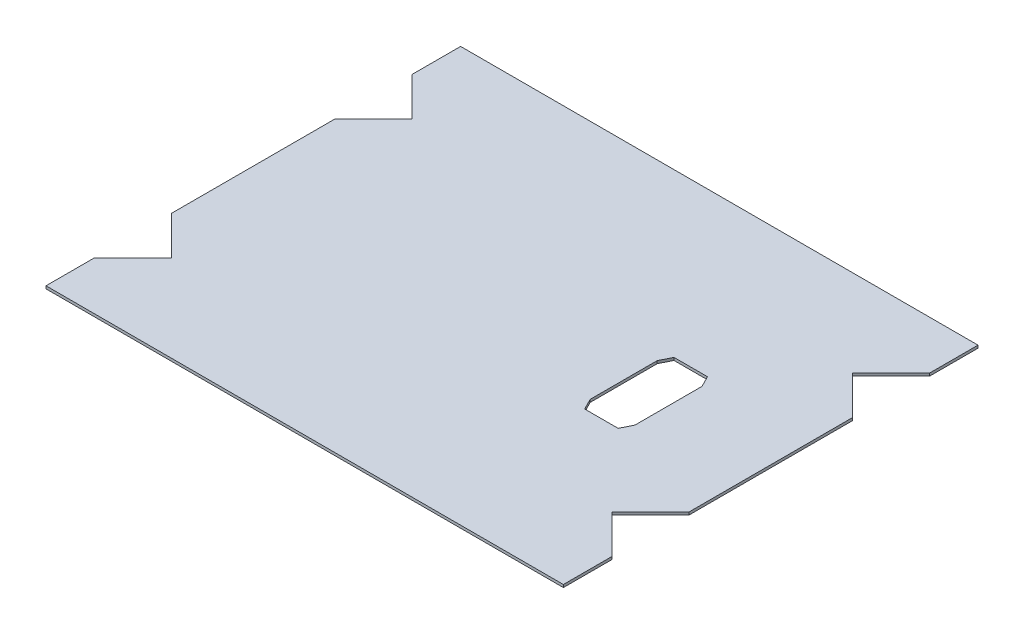
ISO-10303-21;
HEADER;
FILE_DESCRIPTION(('STEP AP214'),'2;1');
FILE_NAME('part.step','',(''),(''),'','','');
FILE_SCHEMA(('AUTOMOTIVE_DESIGN { 1 0 10303 214 1 1 1 1 }'));
ENDSEC;
DATA;
#1=APPLICATION_CONTEXT('core data for automotive mechanical design processes');
#2=APPLICATION_PROTOCOL_DEFINITION('international standard','automotive_design',2000,#1);
#3=PRODUCT_CONTEXT('',#1,'mechanical');
#4=PRODUCT('Part','Part','',(#3));
#5=PRODUCT_RELATED_PRODUCT_CATEGORY('part','',(#4));
#6=PRODUCT_DEFINITION_FORMATION('','',#4);
#7=PRODUCT_DEFINITION_CONTEXT('part definition',#1,'design');
#8=PRODUCT_DEFINITION('design','',#6,#7);
#9=PRODUCT_DEFINITION_SHAPE('','',#8);
#10=(LENGTH_UNIT() NAMED_UNIT(*) SI_UNIT(.MILLI.,.METRE.));
#11=(NAMED_UNIT(*) PLANE_ANGLE_UNIT() SI_UNIT($,.RADIAN.));
#12=(NAMED_UNIT(*) SI_UNIT($,.STERADIAN.) SOLID_ANGLE_UNIT());
#13=UNCERTAINTY_MEASURE_WITH_UNIT(LENGTH_MEASURE(1.E-05),#10,'distance_accuracy_value','');
#14=(GEOMETRIC_REPRESENTATION_CONTEXT(3) GLOBAL_UNCERTAINTY_ASSIGNED_CONTEXT((#13)) GLOBAL_UNIT_ASSIGNED_CONTEXT((#10,
#11,#12)) REPRESENTATION_CONTEXT('',''));
#15=CARTESIAN_POINT('',(0.,0.,0.));
#16=DIRECTION('',(0.,0.,1.));
#17=DIRECTION('',(1.,0.,0.));
#18=AXIS2_PLACEMENT_3D('',#15,#16,#17);
#19=CARTESIAN_POINT('',(0.,1.2,0.));
#20=DIRECTION('',(0.,1.,0.));
#21=DIRECTION('',(0.,0.,1.));
#22=AXIS2_PLACEMENT_3D('',#19,#20,#21);
#23=PLANE('',#22);
#24=DIRECTION('',(0.707106781186545,0.,0.70710678118655));
#25=VECTOR('',#24,1.);
#26=CARTESIAN_POINT('',(125.097205420987,1.19999999999984,-27.3232233047033));
#27=LINE('',#26,#25);
#28=CARTESIAN_POINT('',(98.5334376675488,1.20000000000002,-53.8869910581421));
#29=VERTEX_POINT('',#28);
#30=CARTESIAN_POINT('',(115.773982116284,1.1999999999999,-36.6464466094066));
#31=VERTEX_POINT('',#30);
#32=EDGE_CURVE('E821',#29,#31,#27,.T.);
#33=ORIENTED_EDGE('',*,*,#32,.F.);
#34=DIRECTION('',(0.707106781186545,0.,-0.70710678118655));
#35=VECTOR('',#34,1.);
#36=CARTESIAN_POINT('',(125.097205420987,1.19999999999966,-80.4507588115806));
#37=LINE('',#36,#35);
#38=CARTESIAN_POINT('',(115.773982116284,1.19999999999979,-71.1275355068775));
#39=VERTEX_POINT('',#38);
#40=EDGE_CURVE('E710',#29,#39,#37,.T.);
#41=ORIENTED_EDGE('',*,*,#40,.T.);
#42=DIRECTION('',(0.,0.,-1.));
#43=VECTOR('',#42,1.);
#44=CARTESIAN_POINT('',(115.773982116284,1.19999999999991,-54.9739821162841));
#45=LINE('',#44,#43);
#46=CARTESIAN_POINT('',(115.773982116284,1.19999999999962,-92.7739821162841));
#47=VERTEX_POINT('',#46);
#48=EDGE_CURVE('E721',#47,#39,#45,.F.);
#49=ORIENTED_EDGE('',*,*,#48,.F.);
#50=DIRECTION('',(-1.,0.,0.));
#51=VECTOR('',#50,1.);
#52=CARTESIAN_POINT('',(-98.9739821162841,1.19999999999975,-92.7739821162841));
#53=LINE('',#52,#51);
#54=CARTESIAN_POINT('',(-115.773982116284,1.19999999999962,-92.7739821162841));
#55=VERTEX_POINT('',#54);
#56=EDGE_CURVE('E738',#55,#47,#53,.F.);
#57=ORIENTED_EDGE('',*,*,#56,.F.);
#58=DIRECTION('',(0.,0.,1.));
#59=VECTOR('',#58,1.);
#60=CARTESIAN_POINT('',(-115.773982116284,1.19999999999962,-92.7739821162841));
#61=LINE('',#60,#59);
#62=CARTESIAN_POINT('',(-115.773982116284,1.19999999999978,-71.1275355068775));
#63=VERTEX_POINT('',#62);
#64=EDGE_CURVE('E735',#63,#55,#61,.F.);
#65=ORIENTED_EDGE('',*,*,#64,.F.);
#66=DIRECTION('',(0.707106781186545,0.,0.70710678118655));
#67=VECTOR('',#66,1.);
#68=CARTESIAN_POINT('',(-125.097205420987,1.19999999999966,-80.4507588115806));
#69=LINE('',#68,#67);
#70=CARTESIAN_POINT('',(-98.5334376675488,1.20000000000002,-53.8869910581421));
#71=VERTEX_POINT('',#70);
#72=EDGE_CURVE('E714',#63,#71,#69,.T.);
#73=ORIENTED_EDGE('',*,*,#72,.T.);
#74=DIRECTION('',(-0.707106781186545,0.,0.70710678118655));
#75=VECTOR('',#74,1.);
#76=CARTESIAN_POINT('',(-125.097205420987,1.19999999999981,-27.3232233047034));
#77=LINE('',#76,#75);
#78=CARTESIAN_POINT('',(-115.773982116284,1.19999999999988,-36.6464466094066));
#79=VERTEX_POINT('',#78);
#80=EDGE_CURVE('E681',#71,#79,#77,.T.);
#81=ORIENTED_EDGE('',*,*,#80,.T.);
#82=DIRECTION('',(0.,0.,1.));
#83=VECTOR('',#82,1.);
#84=CARTESIAN_POINT('',(-115.773982116284,1.19999999999985,-52.8));
#85=LINE('',#84,#83);
#86=CARTESIAN_POINT('',(-115.773982116284,1.1999999999999,36.6464466094067));
#87=VERTEX_POINT('',#86);
#88=EDGE_CURVE('E747',#87,#79,#85,.F.);
#89=ORIENTED_EDGE('',*,*,#88,.F.);
#90=DIRECTION('',(0.707106781186545,0.,0.70710678118655));
#91=VECTOR('',#90,1.);
#92=CARTESIAN_POINT('',(-125.097205420987,1.19999999999981,27.3232233047034));
#93=LINE('',#92,#91);
#94=CARTESIAN_POINT('',(-98.5334376675488,1.20000000000001,53.8869910581421));
#95=VERTEX_POINT('',#94);
#96=EDGE_CURVE('E809',#87,#95,#93,.T.);
#97=ORIENTED_EDGE('',*,*,#96,.T.);
#98=DIRECTION('',(-0.707106781186545,0.,0.70710678118655));
#99=VECTOR('',#98,1.);
#100=CARTESIAN_POINT('',(-125.097205420987,1.19999999999963,80.4507588115806));
#101=LINE('',#100,#99);
#102=CARTESIAN_POINT('',(-115.773982116284,1.19999999999976,71.1275355068776));
#103=VERTEX_POINT('',#102);
#104=EDGE_CURVE('E762',#95,#103,#101,.T.);
#105=ORIENTED_EDGE('',*,*,#104,.T.);
#106=DIRECTION('',(0.,0.,1.));
#107=VECTOR('',#106,1.);
#108=CARTESIAN_POINT('',(-115.773982116284,1.19999999999988,54.9739821162841));
#109=LINE('',#108,#107);
#110=CARTESIAN_POINT('',(-115.773982116284,1.1999999999996,92.7739821162842));
#111=VERTEX_POINT('',#110);
#112=EDGE_CURVE('E770',#111,#103,#109,.F.);
#113=ORIENTED_EDGE('',*,*,#112,.F.);
#114=DIRECTION('',(1.,0.,0.));
#115=VECTOR('',#114,1.);
#116=CARTESIAN_POINT('',(-115.773982116284,1.1999999999996,92.7739821162842));
#117=LINE('',#116,#115);
#118=CARTESIAN_POINT('',(115.773982116284,1.19999999999968,92.7739821162842));
#119=VERTEX_POINT('',#118);
#120=EDGE_CURVE('E705',#119,#111,#117,.F.);
#121=ORIENTED_EDGE('',*,*,#120,.F.);
#122=DIRECTION('',(0.,0.,1.));
#123=VECTOR('',#122,1.);
#124=CARTESIAN_POINT('',(115.773982116284,1.19999999999983,54.9739821162842));
#125=LINE('',#124,#123);
#126=CARTESIAN_POINT('',(115.773982116284,1.19999999999976,71.1275355068776));
#127=VERTEX_POINT('',#126);
#128=EDGE_CURVE('E784',#127,#119,#125,.T.);
#129=ORIENTED_EDGE('',*,*,#128,.F.);
#130=DIRECTION('',(0.707106781186543,0.,0.707106781186552));
#131=VECTOR('',#130,1.);
#132=CARTESIAN_POINT('',(125.097205420987,1.19999999999967,80.4507588115807));
#133=LINE('',#132,#131);
#134=CARTESIAN_POINT('',(98.5334376675488,1.19999999999994,53.8869910581421));
#135=VERTEX_POINT('',#134);
#136=EDGE_CURVE('E758',#135,#127,#133,.T.);
#137=ORIENTED_EDGE('',*,*,#136,.F.);
#138=DIRECTION('',(-0.707106781186545,0.,0.70710678118655));
#139=VECTOR('',#138,1.);
#140=CARTESIAN_POINT('',(125.097205420987,1.19999999999985,27.3232233047033));
#141=LINE('',#140,#139);
#142=CARTESIAN_POINT('',(115.773982116284,1.19999999999992,36.6464466094066));
#143=VERTEX_POINT('',#142);
#144=EDGE_CURVE('E832',#143,#135,#141,.T.);
#145=ORIENTED_EDGE('',*,*,#144,.F.);
#146=DIRECTION('',(0.,0.,1.));
#147=VECTOR('',#146,1.);
#148=CARTESIAN_POINT('',(115.773982116284,1.1999999999999,-52.8));
#149=LINE('',#148,#147);
#150=EDGE_CURVE('E798',#31,#143,#149,.T.);
#151=ORIENTED_EDGE('',*,*,#150,.F.);
#152=EDGE_LOOP('',(#33,#41,#49,#57,#65,#73,#81,#89,#97,#105,#113,#121,#129,#137,#145,#151));
#153=FACE_BOUND('',#152,.T.);
#154=DIRECTION('',(1.,0.,0.));
#155=VECTOR('',#154,1.);
#156=CARTESIAN_POINT('',(67.5000000000001,1.2,20.));
#157=LINE('',#156,#155);
#158=CARTESIAN_POINT('',(52.5000000000001,1.2,20.));
#159=VERTEX_POINT('',#158);
#160=CARTESIAN_POINT('',(67.5000000000001,1.2,20.));
#161=VERTEX_POINT('',#160);
#162=EDGE_CURVE('E845',#159,#161,#157,.T.);
#163=ORIENTED_EDGE('',*,*,#162,.F.);
#164=DIRECTION('',(0.447213595499956,0.,0.894427190999917));
#165=VECTOR('',#164,1.);
#166=CARTESIAN_POINT('',(50.0000000000001,1.2,15.));
#167=LINE('',#166,#165);
#168=CARTESIAN_POINT('',(50.0000000000001,1.2,15.));
#169=VERTEX_POINT('',#168);
#170=EDGE_CURVE('E842',#169,#159,#167,.T.);
#171=ORIENTED_EDGE('',*,*,#170,.F.);
#172=DIRECTION('',(0.,0.,1.));
#173=VECTOR('',#172,1.);
#174=CARTESIAN_POINT('',(50.0000000000001,1.2,-15.));
#175=LINE('',#174,#173);
#176=CARTESIAN_POINT('',(50.0000000000001,1.2,-15.));
#177=VERTEX_POINT('',#176);
#178=EDGE_CURVE('E864',#177,#169,#175,.T.);
#179=ORIENTED_EDGE('',*,*,#178,.F.);
#180=DIRECTION('',(-0.447213595499956,0.,0.894427190999917));
#181=VECTOR('',#180,1.);
#182=CARTESIAN_POINT('',(50.0000000000001,1.2,-15.));
#183=LINE('',#182,#181);
#184=CARTESIAN_POINT('',(52.5000000000001,1.2,-20.));
#185=VERTEX_POINT('',#184);
#186=EDGE_CURVE('E861',#185,#177,#183,.T.);
#187=ORIENTED_EDGE('',*,*,#186,.F.);
#188=DIRECTION('',(-1.,0.,0.));
#189=VECTOR('',#188,1.);
#190=CARTESIAN_POINT('',(67.5000000000001,1.2,-20.));
#191=LINE('',#190,#189);
#192=CARTESIAN_POINT('',(67.5000000000001,1.2,-20.));
#193=VERTEX_POINT('',#192);
#194=EDGE_CURVE('E858',#193,#185,#191,.T.);
#195=ORIENTED_EDGE('',*,*,#194,.F.);
#196=DIRECTION('',(-0.447213595499958,0.,-0.894427190999916));
#197=VECTOR('',#196,1.);
#198=CARTESIAN_POINT('',(70.0000000000001,1.2,-15.));
#199=LINE('',#198,#197);
#200=CARTESIAN_POINT('',(70.0000000000001,1.2,-15.));
#201=VERTEX_POINT('',#200);
#202=EDGE_CURVE('E855',#201,#193,#199,.T.);
#203=ORIENTED_EDGE('',*,*,#202,.F.);
#204=DIRECTION('',(0.,0.,-1.));
#205=VECTOR('',#204,1.);
#206=CARTESIAN_POINT('',(70.0000000000001,1.2,-15.));
#207=LINE('',#206,#205);
#208=CARTESIAN_POINT('',(70.0000000000001,1.2,15.));
#209=VERTEX_POINT('',#208);
#210=EDGE_CURVE('E852',#209,#201,#207,.T.);
#211=ORIENTED_EDGE('',*,*,#210,.F.);
#212=DIRECTION('',(0.447213595499958,0.,-0.894427190999916));
#213=VECTOR('',#212,1.);
#214=CARTESIAN_POINT('',(70.0000000000001,1.2,15.));
#215=LINE('',#214,#213);
#216=EDGE_CURVE('E849',#161,#209,#215,.T.);
#217=ORIENTED_EDGE('',*,*,#216,.F.);
#218=EDGE_LOOP('',(#163,#171,#179,#187,#195,#203,#211,#217));
#219=FACE_BOUND('',#218,.T.);
#220=ADVANCED_FACE('F495',(#153,#219),#23,.T.);
#221=CARTESIAN_POINT('',(0.,0.,0.));
#222=DIRECTION('',(0.,1.,0.));
#223=DIRECTION('',(0.,0.,1.));
#224=AXIS2_PLACEMENT_3D('',#221,#222,#223);
#225=PLANE('',#224);
#226=DIRECTION('',(0.707106781186545,0.,-0.70710678118655));
#227=VECTOR('',#226,1.);
#228=CARTESIAN_POINT('',(99.9739821162841,0.,-55.3275355068774));
#229=LINE('',#228,#227);
#230=CARTESIAN_POINT('',(98.5334376675488,0.,-53.8869910581421));
#231=VERTEX_POINT('',#230);
#232=CARTESIAN_POINT('',(115.773982116284,-2.28983498828939E-13,-71.1275355068775));
#233=VERTEX_POINT('',#232);
#234=EDGE_CURVE('E668',#231,#233,#229,.T.);
#235=ORIENTED_EDGE('',*,*,#234,.F.);
#236=DIRECTION('',(-0.707106781186545,0.,-0.70710678118655));
#237=VECTOR('',#236,1.);
#238=CARTESIAN_POINT('',(174.98597798299,-5.13478148889135E-13,22.5655492572994));
#239=LINE('',#238,#237);
#240=CARTESIAN_POINT('',(115.773982116284,-1.11022302462516E-13,-36.6464466094066));
#241=VERTEX_POINT('',#240);
#242=EDGE_CURVE('E814',#241,#231,#239,.T.);
#243=ORIENTED_EDGE('',*,*,#242,.F.);
#244=DIRECTION('',(0.,0.,-1.));
#245=VECTOR('',#244,1.);
#246=CARTESIAN_POINT('',(115.773982116284,0.,0.));
#247=LINE('',#246,#245);
#248=CARTESIAN_POINT('',(115.773982116284,0.,36.6464466094066));
#249=VERTEX_POINT('',#248);
#250=EDGE_CURVE('E825',#241,#249,#247,.F.);
#251=ORIENTED_EDGE('',*,*,#250,.T.);
#252=DIRECTION('',(0.707106781186545,0.,-0.70710678118655));
#253=VECTOR('',#252,1.);
#254=CARTESIAN_POINT('',(99.9739821162841,0.,52.4464466094067));
#255=LINE('',#254,#253);
#256=CARTESIAN_POINT('',(98.5334376675488,0.,53.8869910581421));
#257=VERTEX_POINT('',#256);
#258=EDGE_CURVE('E828',#257,#249,#255,.T.);
#259=ORIENTED_EDGE('',*,*,#258,.F.);
#260=DIRECTION('',(-0.707106781186543,0.,-0.707106781186552));
#261=VECTOR('',#260,1.);
#262=CARTESIAN_POINT('',(128.725646100053,-3.7470027081099E-13,84.0791994906469));
#263=LINE('',#262,#261);
#264=CARTESIAN_POINT('',(115.773982116284,-2.42861286636753E-13,71.1275355068776));
#265=VERTEX_POINT('',#264);
#266=EDGE_CURVE('E751',#265,#257,#263,.T.);
#267=ORIENTED_EDGE('',*,*,#266,.F.);
#268=DIRECTION('',(0.,0.,-1.));
#269=VECTOR('',#268,1.);
#270=CARTESIAN_POINT('',(115.773982116284,-1.80411241501588E-13,52.7739821162842));
#271=LINE('',#270,#269);
#272=CARTESIAN_POINT('',(115.773982116284,-3.2612801348364E-13,92.7739821162842));
#273=VERTEX_POINT('',#272);
#274=EDGE_CURVE('E781',#265,#273,#271,.F.);
#275=ORIENTED_EDGE('',*,*,#274,.T.);
#276=DIRECTION('',(1.,0.,0.));
#277=VECTOR('',#276,1.);
#278=CARTESIAN_POINT('',(152.773982116284,-5.759281940243E-13,92.7739821162843));
#279=LINE('',#278,#277);
#280=CARTESIAN_POINT('',(-115.773982116284,-4.09394740330526E-13,92.7739821162842));
#281=VERTEX_POINT('',#280);
#282=EDGE_CURVE('E778',#273,#281,#279,.F.);
#283=ORIENTED_EDGE('',*,*,#282,.T.);
#284=DIRECTION('',(0.,0.,-1.));
#285=VECTOR('',#284,1.);
#286=CARTESIAN_POINT('',(-115.773982116284,-1.11022302462516E-13,52.7739821162841));
#287=LINE('',#286,#285);
#288=CARTESIAN_POINT('',(-115.773982116284,-2.56739074444567E-13,71.1275355068776));
#289=VERTEX_POINT('',#288);
#290=EDGE_CURVE('E766',#281,#289,#287,.T.);
#291=ORIENTED_EDGE('',*,*,#290,.T.);
#292=DIRECTION('',(-0.707106781186545,0.,0.70710678118655));
#293=VECTOR('',#292,1.);
#294=CARTESIAN_POINT('',(-99.9739821162841,0.,55.3275355068775));
#295=LINE('',#294,#293);
#296=CARTESIAN_POINT('',(-98.5334376675487,0.,53.8869910581421));
#297=VERTEX_POINT('',#296);
#298=EDGE_CURVE('E748',#297,#289,#295,.T.);
#299=ORIENTED_EDGE('',*,*,#298,.F.);
#300=DIRECTION('',(0.707106781186545,0.,0.70710678118655));
#301=VECTOR('',#300,1.);
#302=CARTESIAN_POINT('',(-174.98597798299,-5.82867087928207E-13,-22.5655492572994));
#303=LINE('',#302,#301);
#304=CARTESIAN_POINT('',(-115.773982116284,-1.11022302462516E-13,36.6464466094067));
#305=VERTEX_POINT('',#304);
#306=EDGE_CURVE('E794',#305,#297,#303,.T.);
#307=ORIENTED_EDGE('',*,*,#306,.F.);
#308=DIRECTION('',(0.,0.,-1.));
#309=VECTOR('',#308,1.);
#310=CARTESIAN_POINT('',(-115.773982116284,-1.2490009027033E-13,0.));
#311=LINE('',#310,#309);
#312=CARTESIAN_POINT('',(-115.773982116284,-1.52655665885959E-13,-36.6464466094066));
#313=VERTEX_POINT('',#312);
#314=EDGE_CURVE('E675',#305,#313,#311,.T.);
#315=ORIENTED_EDGE('',*,*,#314,.T.);
#316=DIRECTION('',(-0.707106781186545,0.,0.70710678118655));
#317=VECTOR('',#316,1.);
#318=CARTESIAN_POINT('',(-99.9739821162841,0.,-52.4464466094067));
#319=LINE('',#318,#317);
#320=CARTESIAN_POINT('',(-98.5334376675488,0.,-53.8869910581421));
#321=VERTEX_POINT('',#320);
#322=EDGE_CURVE('E671',#321,#313,#319,.T.);
#323=ORIENTED_EDGE('',*,*,#322,.F.);
#324=DIRECTION('',(0.707106781186545,0.,0.70710678118655));
#325=VECTOR('',#324,1.);
#326=CARTESIAN_POINT('',(-128.725646100053,-4.02455846426619E-13,-84.0791994906468));
#327=LINE('',#326,#325);
#328=CARTESIAN_POINT('',(-115.773982116284,-2.28983498828939E-13,-71.1275355068775));
#329=VERTEX_POINT('',#328);
#330=EDGE_CURVE('E658',#329,#321,#327,.T.);
#331=ORIENTED_EDGE('',*,*,#330,.F.);
#332=DIRECTION('',(0.,0.,-1.));
#333=VECTOR('',#332,1.);
#334=CARTESIAN_POINT('',(-115.773982116284,0.,-52.7739821162841));
#335=LINE('',#334,#333);
#336=CARTESIAN_POINT('',(-115.773982116284,-3.81639164714898E-13,-92.7739821162841));
#337=VERTEX_POINT('',#336);
#338=EDGE_CURVE('E732',#329,#337,#335,.T.);
#339=ORIENTED_EDGE('',*,*,#338,.T.);
#340=DIRECTION('',(1.,0.,0.));
#341=VECTOR('',#340,1.);
#342=CARTESIAN_POINT('',(-152.773982116284,-6.31439345255558E-13,-92.7739821162841));
#343=LINE('',#342,#341);
#344=CARTESIAN_POINT('',(115.773982116284,-3.81639164714898E-13,-92.7739821162841));
#345=VERTEX_POINT('',#344);
#346=EDGE_CURVE('E729',#337,#345,#343,.T.);
#347=ORIENTED_EDGE('',*,*,#346,.T.);
#348=DIRECTION('',(0.,0.,1.));
#349=VECTOR('',#348,1.);
#350=CARTESIAN_POINT('',(115.773982116284,0.,-52.7739821162841));
#351=LINE('',#350,#349);
#352=EDGE_CURVE('E717',#345,#233,#351,.T.);
#353=ORIENTED_EDGE('',*,*,#352,.T.);
#354=EDGE_LOOP('',(#235,#243,#251,#259,#267,#275,#283,#291,#299,#307,#315,#323,#331,#339,#347,#353));
#355=FACE_BOUND('',#354,.T.);
#356=DIRECTION('',(0.447213595499956,0.,0.894427190999917));
#357=VECTOR('',#356,1.);
#358=CARTESIAN_POINT('',(50.0000000000001,0.,15.));
#359=LINE('',#358,#357);
#360=CARTESIAN_POINT('',(50.0000000000001,0.,15.));
#361=VERTEX_POINT('',#360);
#362=CARTESIAN_POINT('',(52.5000000000001,0.,20.));
#363=VERTEX_POINT('',#362);
#364=EDGE_CURVE('E518',#361,#363,#359,.T.);
#365=ORIENTED_EDGE('',*,*,#364,.T.);
#366=DIRECTION('',(1.,0.,0.));
#367=VECTOR('',#366,1.);
#368=CARTESIAN_POINT('',(67.5000000000001,0.,20.));
#369=LINE('',#368,#367);
#370=CARTESIAN_POINT('',(67.5000000000001,0.,20.));
#371=VERTEX_POINT('',#370);
#372=EDGE_CURVE('E870',#363,#371,#369,.T.);
#373=ORIENTED_EDGE('',*,*,#372,.T.);
#374=DIRECTION('',(0.447213595499958,0.,-0.894427190999916));
#375=VECTOR('',#374,1.);
#376=CARTESIAN_POINT('',(70.0000000000001,0.,15.));
#377=LINE('',#376,#375);
#378=CARTESIAN_POINT('',(70.0000000000001,0.,15.));
#379=VERTEX_POINT('',#378);
#380=EDGE_CURVE('E874',#371,#379,#377,.T.);
#381=ORIENTED_EDGE('',*,*,#380,.T.);
#382=DIRECTION('',(0.,0.,-1.));
#383=VECTOR('',#382,1.);
#384=CARTESIAN_POINT('',(70.0000000000001,0.,-15.));
#385=LINE('',#384,#383);
#386=CARTESIAN_POINT('',(70.0000000000001,0.,-15.));
#387=VERTEX_POINT('',#386);
#388=EDGE_CURVE('E878',#379,#387,#385,.T.);
#389=ORIENTED_EDGE('',*,*,#388,.T.);
#390=DIRECTION('',(-0.447213595499958,0.,-0.894427190999916));
#391=VECTOR('',#390,1.);
#392=CARTESIAN_POINT('',(70.0000000000001,0.,-15.));
#393=LINE('',#392,#391);
#394=CARTESIAN_POINT('',(67.5000000000001,0.,-20.));
#395=VERTEX_POINT('',#394);
#396=EDGE_CURVE('E882',#387,#395,#393,.T.);
#397=ORIENTED_EDGE('',*,*,#396,.T.);
#398=DIRECTION('',(-1.,0.,0.));
#399=VECTOR('',#398,1.);
#400=CARTESIAN_POINT('',(67.5000000000001,0.,-20.));
#401=LINE('',#400,#399);
#402=CARTESIAN_POINT('',(52.5000000000001,0.,-20.));
#403=VERTEX_POINT('',#402);
#404=EDGE_CURVE('E886',#395,#403,#401,.T.);
#405=ORIENTED_EDGE('',*,*,#404,.T.);
#406=DIRECTION('',(-0.447213595499956,0.,0.894427190999917));
#407=VECTOR('',#406,1.);
#408=CARTESIAN_POINT('',(50.0000000000001,0.,-15.));
#409=LINE('',#408,#407);
#410=CARTESIAN_POINT('',(50.0000000000001,0.,-15.));
#411=VERTEX_POINT('',#410);
#412=EDGE_CURVE('E890',#403,#411,#409,.T.);
#413=ORIENTED_EDGE('',*,*,#412,.T.);
#414=DIRECTION('',(0.,0.,1.));
#415=VECTOR('',#414,1.);
#416=CARTESIAN_POINT('',(50.0000000000001,0.,-15.));
#417=LINE('',#416,#415);
#418=EDGE_CURVE('E846',#411,#361,#417,.T.);
#419=ORIENTED_EDGE('',*,*,#418,.T.);
#420=EDGE_LOOP('',(#365,#373,#381,#389,#397,#405,#413,#419));
#421=FACE_BOUND('',#420,.T.);
#422=ADVANCED_FACE('F497',(#355,#421),#225,.F.);
#423=CARTESIAN_POINT('',(50.0000000000001,1.2,15.));
#424=DIRECTION('',(0.894427190999917,0.,-0.447213595499956));
#425=DIRECTION('',(-0.447213595499956,0.,-0.894427190999917));
#426=AXIS2_PLACEMENT_3D('',#423,#424,#425);
#427=PLANE('',#426);
#428=ORIENTED_EDGE('',*,*,#364,.F.);
#429=DIRECTION('',(0.,-1.,0.));
#430=VECTOR('',#429,1.);
#431=CARTESIAN_POINT('',(50.0000000000001,1.2,15.));
#432=LINE('',#431,#430);
#433=EDGE_CURVE('E867',#169,#361,#432,.T.);
#434=ORIENTED_EDGE('',*,*,#433,.F.);
#435=ORIENTED_EDGE('',*,*,#170,.T.);
#436=DIRECTION('',(0.,-1.,0.));
#437=VECTOR('',#436,1.);
#438=CARTESIAN_POINT('',(52.5000000000001,1.2,20.));
#439=LINE('',#438,#437);
#440=EDGE_CURVE('E13',#159,#363,#439,.T.);
#441=ORIENTED_EDGE('',*,*,#440,.T.);
#442=EDGE_LOOP('',(#428,#434,#435,#441));
#443=FACE_BOUND('',#442,.T.);
#444=ADVANCED_FACE('F928',(#443),#427,.T.);
#445=CARTESIAN_POINT('',(67.5000000000001,1.2,20.));
#446=DIRECTION('',(0.,0.,-1.));
#447=DIRECTION('',(-1.,0.,0.));
#448=AXIS2_PLACEMENT_3D('',#445,#446,#447);
#449=PLANE('',#448);
#450=ORIENTED_EDGE('',*,*,#372,.F.);
#451=ORIENTED_EDGE('',*,*,#440,.F.);
#452=ORIENTED_EDGE('',*,*,#162,.T.);
#453=DIRECTION('',(0.,-1.,0.));
#454=VECTOR('',#453,1.);
#455=CARTESIAN_POINT('',(67.5000000000001,1.2,20.));
#456=LINE('',#455,#454);
#457=EDGE_CURVE('E504',#161,#371,#456,.T.);
#458=ORIENTED_EDGE('',*,*,#457,.T.);
#459=EDGE_LOOP('',(#450,#451,#452,#458));
#460=FACE_BOUND('',#459,.T.);
#461=ADVANCED_FACE('F916',(#460),#449,.T.);
#462=CARTESIAN_POINT('',(70.0000000000001,1.2,15.));
#463=DIRECTION('',(-0.894427190999916,0.,-0.447213595499958));
#464=DIRECTION('',(-0.447213595499958,0.,0.894427190999916));
#465=AXIS2_PLACEMENT_3D('',#462,#463,#464);
#466=PLANE('',#465);
#467=ORIENTED_EDGE('',*,*,#380,.F.);
#468=ORIENTED_EDGE('',*,*,#457,.F.);
#469=ORIENTED_EDGE('',*,*,#216,.T.);
#470=DIRECTION('',(0.,-1.,0.));
#471=VECTOR('',#470,1.);
#472=CARTESIAN_POINT('',(70.0000000000001,1.2,15.));
#473=LINE('',#472,#471);
#474=EDGE_CURVE('E910',#209,#379,#473,.T.);
#475=ORIENTED_EDGE('',*,*,#474,.T.);
#476=EDGE_LOOP('',(#467,#468,#469,#475));
#477=FACE_BOUND('',#476,.T.);
#478=ADVANCED_FACE('F921',(#477),#466,.T.);
#479=CARTESIAN_POINT('',(70.0000000000001,1.2,-15.));
#480=DIRECTION('',(-1.,0.,0.));
#481=DIRECTION('',(0.,0.,1.));
#482=AXIS2_PLACEMENT_3D('',#479,#480,#481);
#483=PLANE('',#482);
#484=ORIENTED_EDGE('',*,*,#388,.F.);
#485=ORIENTED_EDGE('',*,*,#474,.F.);
#486=ORIENTED_EDGE('',*,*,#210,.T.);
#487=DIRECTION('',(0.,-1.,0.));
#488=VECTOR('',#487,1.);
#489=CARTESIAN_POINT('',(70.0000000000001,1.2,-15.));
#490=LINE('',#489,#488);
#491=EDGE_CURVE('E907',#201,#387,#490,.T.);
#492=ORIENTED_EDGE('',*,*,#491,.T.);
#493=EDGE_LOOP('',(#484,#485,#486,#492));
#494=FACE_BOUND('',#493,.T.);
#495=ADVANCED_FACE('F934',(#494),#483,.T.);
#496=CARTESIAN_POINT('',(70.0000000000001,1.2,-15.));
#497=DIRECTION('',(-0.894427190999916,0.,0.447213595499958));
#498=DIRECTION('',(0.447213595499958,0.,0.894427190999916));
#499=AXIS2_PLACEMENT_3D('',#496,#497,#498);
#500=PLANE('',#499);
#501=ORIENTED_EDGE('',*,*,#396,.F.);
#502=ORIENTED_EDGE('',*,*,#491,.F.);
#503=ORIENTED_EDGE('',*,*,#202,.T.);
#504=DIRECTION('',(0.,-1.,0.));
#505=VECTOR('',#504,1.);
#506=CARTESIAN_POINT('',(67.5000000000001,1.2,-20.));
#507=LINE('',#506,#505);
#508=EDGE_CURVE('E904',#193,#395,#507,.T.);
#509=ORIENTED_EDGE('',*,*,#508,.T.);
#510=EDGE_LOOP('',(#501,#502,#503,#509));
#511=FACE_BOUND('',#510,.T.);
#512=ADVANCED_FACE('F939',(#511),#500,.T.);
#513=CARTESIAN_POINT('',(67.5000000000001,1.2,-20.));
#514=DIRECTION('',(0.,0.,1.));
#515=DIRECTION('',(1.,0.,0.));
#516=AXIS2_PLACEMENT_3D('',#513,#514,#515);
#517=PLANE('',#516);
#518=ORIENTED_EDGE('',*,*,#404,.F.);
#519=ORIENTED_EDGE('',*,*,#508,.F.);
#520=ORIENTED_EDGE('',*,*,#194,.T.);
#521=DIRECTION('',(0.,-1.,0.));
#522=VECTOR('',#521,1.);
#523=CARTESIAN_POINT('',(52.5000000000001,1.2,-20.));
#524=LINE('',#523,#522);
#525=EDGE_CURVE('E901',#185,#403,#524,.T.);
#526=ORIENTED_EDGE('',*,*,#525,.T.);
#527=EDGE_LOOP('',(#518,#519,#520,#526));
#528=FACE_BOUND('',#527,.T.);
#529=ADVANCED_FACE('F943',(#528),#517,.T.);
#530=CARTESIAN_POINT('',(50.0000000000001,1.2,-15.));
#531=DIRECTION('',(0.894427190999917,0.,0.447213595499956));
#532=DIRECTION('',(0.447213595499956,0.,-0.894427190999917));
#533=AXIS2_PLACEMENT_3D('',#530,#531,#532);
#534=PLANE('',#533);
#535=ORIENTED_EDGE('',*,*,#412,.F.);
#536=ORIENTED_EDGE('',*,*,#525,.F.);
#537=ORIENTED_EDGE('',*,*,#186,.T.);
#538=DIRECTION('',(0.,-1.,0.));
#539=VECTOR('',#538,1.);
#540=CARTESIAN_POINT('',(50.0000000000001,1.2,-15.));
#541=LINE('',#540,#539);
#542=EDGE_CURVE('E511',#177,#411,#541,.T.);
#543=ORIENTED_EDGE('',*,*,#542,.T.);
#544=EDGE_LOOP('',(#535,#536,#537,#543));
#545=FACE_BOUND('',#544,.T.);
#546=ADVANCED_FACE('F946',(#545),#534,.T.);
#547=CARTESIAN_POINT('',(50.0000000000001,1.2,-15.));
#548=DIRECTION('',(1.,0.,0.));
#549=DIRECTION('',(0.,0.,-1.));
#550=AXIS2_PLACEMENT_3D('',#547,#548,#549);
#551=PLANE('',#550);
#552=ORIENTED_EDGE('',*,*,#418,.F.);
#553=ORIENTED_EDGE('',*,*,#542,.F.);
#554=ORIENTED_EDGE('',*,*,#178,.T.);
#555=ORIENTED_EDGE('',*,*,#433,.T.);
#556=EDGE_LOOP('',(#552,#553,#554,#555));
#557=FACE_BOUND('',#556,.T.);
#558=ADVANCED_FACE('F925',(#557),#551,.T.);
#559=CARTESIAN_POINT('',(115.773982116284,-1.11022302462516E-13,-52.8));
#560=DIRECTION('',(-1.,0.,0.));
#561=DIRECTION('',(0.,-1.,0.));
#562=AXIS2_PLACEMENT_3D('',#559,#560,#561);
#563=PLANE('',#562);
#564=DIRECTION('',(0.,-1.,0.));
#565=VECTOR('',#564,1.);
#566=CARTESIAN_POINT('',(115.773982116284,-1.11022302462516E-13,-36.6464466094066));
#567=LINE('',#566,#565);
#568=EDGE_CURVE('E817',#31,#241,#567,.T.);
#569=ORIENTED_EDGE('',*,*,#568,.F.);
#570=ORIENTED_EDGE('',*,*,#150,.T.);
#571=DIRECTION('',(0.,1.,0.));
#572=VECTOR('',#571,1.);
#573=CARTESIAN_POINT('',(115.773982116284,0.,36.6464466094066));
#574=LINE('',#573,#572);
#575=EDGE_CURVE('E836',#249,#143,#574,.T.);
#576=ORIENTED_EDGE('',*,*,#575,.F.);
#577=ORIENTED_EDGE('',*,*,#250,.F.);
#578=EDGE_LOOP('',(#569,#570,#576,#577));
#579=FACE_BOUND('',#578,.T.);
#580=ADVANCED_FACE('F953',(#579),#563,.F.);
#581=CARTESIAN_POINT('',(99.9739821162841,0.,52.4464466094067));
#582=DIRECTION('',(0.70710678118655,0.,0.707106781186545));
#583=DIRECTION('',(-0.707106781186545,0.,0.70710678118655));
#584=AXIS2_PLACEMENT_3D('',#581,#582,#583);
#585=PLANE('',#584);
#586=ORIENTED_EDGE('',*,*,#575,.T.);
#587=ORIENTED_EDGE('',*,*,#144,.T.);
#588=DIRECTION('',(0.,1.,0.));
#589=VECTOR('',#588,1.);
#590=CARTESIAN_POINT('',(98.5334376675488,0.,53.8869910581421));
#591=LINE('',#590,#589);
#592=EDGE_CURVE('E697',#257,#135,#591,.T.);
#593=ORIENTED_EDGE('',*,*,#592,.F.);
#594=ORIENTED_EDGE('',*,*,#258,.T.);
#595=EDGE_LOOP('',(#586,#587,#593,#594));
#596=FACE_BOUND('',#595,.T.);
#597=ADVANCED_FACE('F1002',(#596),#585,.T.);
#598=CARTESIAN_POINT('',(174.98597798299,-5.13478148889135E-13,22.5655492572994));
#599=DIRECTION('',(0.70710678118655,0.,-0.707106781186545));
#600=DIRECTION('',(0.707106781186545,0.,0.70710678118655));
#601=AXIS2_PLACEMENT_3D('',#598,#599,#600);
#602=PLANE('',#601);
#603=ORIENTED_EDGE('',*,*,#242,.T.);
#604=DIRECTION('',(0.,1.,0.));
#605=VECTOR('',#604,1.);
#606=CARTESIAN_POINT('',(98.5334376675488,0.,-53.8869910581421));
#607=LINE('',#606,#605);
#608=EDGE_CURVE('E691',#231,#29,#607,.T.);
#609=ORIENTED_EDGE('',*,*,#608,.T.);
#610=ORIENTED_EDGE('',*,*,#32,.T.);
#611=ORIENTED_EDGE('',*,*,#568,.T.);
#612=EDGE_LOOP('',(#603,#609,#610,#611));
#613=FACE_BOUND('',#612,.T.);
#614=ADVANCED_FACE('F1014',(#613),#602,.T.);
#615=CARTESIAN_POINT('',(-115.773982116284,-1.38777878078145E-13,-52.8));
#616=DIRECTION('',(1.,0.,0.));
#617=DIRECTION('',(0.,1.,0.));
#618=AXIS2_PLACEMENT_3D('',#615,#616,#617);
#619=PLANE('',#618);
#620=DIRECTION('',(0.,-1.,0.));
#621=VECTOR('',#620,1.);
#622=CARTESIAN_POINT('',(-115.773982116284,-1.52655665885959E-13,36.6464466094067));
#623=LINE('',#622,#621);
#624=EDGE_CURVE('E799',#87,#305,#623,.T.);
#625=ORIENTED_EDGE('',*,*,#624,.F.);
#626=ORIENTED_EDGE('',*,*,#88,.T.);
#627=DIRECTION('',(0.,1.,0.));
#628=VECTOR('',#627,1.);
#629=CARTESIAN_POINT('',(-115.773982116284,-1.2490009027033E-13,-36.6464466094066));
#630=LINE('',#629,#628);
#631=EDGE_CURVE('E680',#313,#79,#630,.T.);
#632=ORIENTED_EDGE('',*,*,#631,.F.);
#633=ORIENTED_EDGE('',*,*,#314,.F.);
#634=EDGE_LOOP('',(#625,#626,#632,#633));
#635=FACE_BOUND('',#634,.T.);
#636=ADVANCED_FACE('F1025',(#635),#619,.F.);
#637=CARTESIAN_POINT('',(-99.9739821162841,0.,-52.4464466094067));
#638=DIRECTION('',(-0.70710678118655,0.,-0.707106781186545));
#639=DIRECTION('',(-0.707106781186545,0.,0.70710678118655));
#640=AXIS2_PLACEMENT_3D('',#637,#638,#639);
#641=PLANE('',#640);
#642=ORIENTED_EDGE('',*,*,#80,.F.);
#643=DIRECTION('',(0.,1.,0.));
#644=VECTOR('',#643,1.);
#645=CARTESIAN_POINT('',(-98.5334376675488,0.,-53.8869910581421));
#646=LINE('',#645,#644);
#647=EDGE_CURVE('E663',#321,#71,#646,.T.);
#648=ORIENTED_EDGE('',*,*,#647,.F.);
#649=ORIENTED_EDGE('',*,*,#322,.T.);
#650=ORIENTED_EDGE('',*,*,#631,.T.);
#651=EDGE_LOOP('',(#642,#648,#649,#650));
#652=FACE_BOUND('',#651,.T.);
#653=ADVANCED_FACE('F684',(#652),#641,.T.);
#654=CARTESIAN_POINT('',(-174.98597798299,-5.82867087928207E-13,-22.5655492572994));
#655=DIRECTION('',(-0.70710678118655,0.,0.707106781186545));
#656=DIRECTION('',(0.707106781186545,0.,0.70710678118655));
#657=AXIS2_PLACEMENT_3D('',#654,#655,#656);
#658=PLANE('',#657);
#659=ORIENTED_EDGE('',*,*,#96,.F.);
#660=ORIENTED_EDGE('',*,*,#624,.T.);
#661=ORIENTED_EDGE('',*,*,#306,.T.);
#662=DIRECTION('',(0.,1.,0.));
#663=VECTOR('',#662,1.);
#664=CARTESIAN_POINT('',(-98.5334376675487,0.,53.8869910581421));
#665=LINE('',#664,#663);
#666=EDGE_CURVE('E687',#297,#95,#665,.T.);
#667=ORIENTED_EDGE('',*,*,#666,.T.);
#668=EDGE_LOOP('',(#659,#660,#661,#667));
#669=FACE_BOUND('',#668,.T.);
#670=ADVANCED_FACE('F1046',(#669),#658,.T.);
#671=CARTESIAN_POINT('',(-115.773982116284,-4.09394740330526E-13,92.7739821162842));
#672=DIRECTION('',(0.,0.,-1.));
#673=DIRECTION('',(0.,1.,0.));
#674=AXIS2_PLACEMENT_3D('',#671,#672,#673);
#675=PLANE('',#674);
#676=DIRECTION('',(0.,1.,0.));
#677=VECTOR('',#676,1.);
#678=CARTESIAN_POINT('',(-115.773982116284,-4.09394740330526E-13,92.7739821162842));
#679=LINE('',#678,#677);
#680=EDGE_CURVE('E774',#281,#111,#679,.T.);
#681=ORIENTED_EDGE('',*,*,#680,.F.);
#682=ORIENTED_EDGE('',*,*,#282,.F.);
#683=DIRECTION('',(0.,1.,0.));
#684=VECTOR('',#683,1.);
#685=CARTESIAN_POINT('',(115.773982116284,-3.2612801348364E-13,92.7739821162842));
#686=LINE('',#685,#684);
#687=EDGE_CURVE('E788',#273,#119,#686,.T.);
#688=ORIENTED_EDGE('',*,*,#687,.T.);
#689=ORIENTED_EDGE('',*,*,#120,.T.);
#690=EDGE_LOOP('',(#681,#682,#688,#689));
#691=FACE_BOUND('',#690,.T.);
#692=ADVANCED_FACE('F1056',(#691),#675,.F.);
#693=CARTESIAN_POINT('',(115.773982116284,-1.80411241501588E-13,54.9739821162842));
#694=DIRECTION('',(-1.,0.,0.));
#695=DIRECTION('',(0.,-1.,0.));
#696=AXIS2_PLACEMENT_3D('',#693,#694,#695);
#697=PLANE('',#696);
#698=DIRECTION('',(0.,-1.,0.));
#699=VECTOR('',#698,1.);
#700=CARTESIAN_POINT('',(115.773982116284,-2.42861286636753E-13,71.1275355068776));
#701=LINE('',#700,#699);
#702=EDGE_CURVE('E754',#127,#265,#701,.T.);
#703=ORIENTED_EDGE('',*,*,#702,.F.);
#704=ORIENTED_EDGE('',*,*,#128,.T.);
#705=ORIENTED_EDGE('',*,*,#687,.F.);
#706=ORIENTED_EDGE('',*,*,#274,.F.);
#707=EDGE_LOOP('',(#703,#704,#705,#706));
#708=FACE_BOUND('',#707,.T.);
#709=ADVANCED_FACE('F1068',(#708),#697,.F.);
#710=CARTESIAN_POINT('',(-115.773982116284,-1.2490009027033E-13,54.9739821162841));
#711=DIRECTION('',(1.,0.,0.));
#712=DIRECTION('',(0.,1.,0.));
#713=AXIS2_PLACEMENT_3D('',#710,#711,#712);
#714=PLANE('',#713);
#715=DIRECTION('',(0.,1.,0.));
#716=VECTOR('',#715,1.);
#717=CARTESIAN_POINT('',(-115.773982116284,-2.56739074444567E-13,71.1275355068776));
#718=LINE('',#717,#716);
#719=EDGE_CURVE('E744',#289,#103,#718,.T.);
#720=ORIENTED_EDGE('',*,*,#719,.F.);
#721=ORIENTED_EDGE('',*,*,#290,.F.);
#722=ORIENTED_EDGE('',*,*,#680,.T.);
#723=ORIENTED_EDGE('',*,*,#112,.T.);
#724=EDGE_LOOP('',(#720,#721,#722,#723));
#725=FACE_BOUND('',#724,.T.);
#726=ADVANCED_FACE('F1081',(#725),#714,.F.);
#727=CARTESIAN_POINT('',(128.725646100053,-3.7470027081099E-13,84.0791994906469));
#728=DIRECTION('',(0.707106781186552,0.,-0.707106781186543));
#729=DIRECTION('',(0.707106781186543,0.,0.707106781186552));
#730=AXIS2_PLACEMENT_3D('',#727,#728,#729);
#731=PLANE('',#730);
#732=ORIENTED_EDGE('',*,*,#266,.T.);
#733=ORIENTED_EDGE('',*,*,#592,.T.);
#734=ORIENTED_EDGE('',*,*,#136,.T.);
#735=ORIENTED_EDGE('',*,*,#702,.T.);
#736=EDGE_LOOP('',(#732,#733,#734,#735));
#737=FACE_BOUND('',#736,.T.);
#738=ADVANCED_FACE('F1092',(#737),#731,.T.);
#739=CARTESIAN_POINT('',(-99.9739821162841,0.,55.3275355068775));
#740=DIRECTION('',(-0.70710678118655,0.,-0.707106781186545));
#741=DIRECTION('',(-0.707106781186545,0.,0.70710678118655));
#742=AXIS2_PLACEMENT_3D('',#739,#740,#741);
#743=PLANE('',#742);
#744=ORIENTED_EDGE('',*,*,#104,.F.);
#745=ORIENTED_EDGE('',*,*,#666,.F.);
#746=ORIENTED_EDGE('',*,*,#298,.T.);
#747=ORIENTED_EDGE('',*,*,#719,.T.);
#748=EDGE_LOOP('',(#744,#745,#746,#747));
#749=FACE_BOUND('',#748,.T.);
#750=ADVANCED_FACE('F1103',(#749),#743,.T.);
#751=CARTESIAN_POINT('',(-98.9739821162841,-2.56739074444567E-13,-92.7739821162841));
#752=DIRECTION('',(0.,0.,1.));
#753=DIRECTION('',(1.,0.,0.));
#754=AXIS2_PLACEMENT_3D('',#751,#752,#753);
#755=PLANE('',#754);
#756=ORIENTED_EDGE('',*,*,#56,.T.);
#757=DIRECTION('',(0.,1.,0.));
#758=VECTOR('',#757,1.);
#759=CARTESIAN_POINT('',(115.773982116284,-3.81639164714898E-13,-92.7739821162841));
#760=LINE('',#759,#758);
#761=EDGE_CURVE('E725',#345,#47,#760,.T.);
#762=ORIENTED_EDGE('',*,*,#761,.F.);
#763=ORIENTED_EDGE('',*,*,#346,.F.);
#764=DIRECTION('',(0.,1.,0.));
#765=VECTOR('',#764,1.);
#766=CARTESIAN_POINT('',(-115.773982116284,-3.81639164714898E-13,-92.7739821162841));
#767=LINE('',#766,#765);
#768=EDGE_CURVE('E701',#337,#55,#767,.T.);
#769=ORIENTED_EDGE('',*,*,#768,.T.);
#770=EDGE_LOOP('',(#756,#762,#763,#769));
#771=FACE_BOUND('',#770,.T.);
#772=ADVANCED_FACE('F1114',(#771),#755,.F.);
#773=CARTESIAN_POINT('',(-115.773982116284,-3.81639164714898E-13,-92.7739821162841));
#774=DIRECTION('',(1.,0.,0.));
#775=DIRECTION('',(0.,-1.,0.));
#776=AXIS2_PLACEMENT_3D('',#773,#774,#775);
#777=PLANE('',#776);
#778=DIRECTION('',(0.,-1.,0.));
#779=VECTOR('',#778,1.);
#780=CARTESIAN_POINT('',(-115.773982116284,-2.28983498828939E-13,-71.1275355068775));
#781=LINE('',#780,#779);
#782=EDGE_CURVE('E664',#63,#329,#781,.T.);
#783=ORIENTED_EDGE('',*,*,#782,.F.);
#784=ORIENTED_EDGE('',*,*,#64,.T.);
#785=ORIENTED_EDGE('',*,*,#768,.F.);
#786=ORIENTED_EDGE('',*,*,#338,.F.);
#787=EDGE_LOOP('',(#783,#784,#785,#786));
#788=FACE_BOUND('',#787,.T.);
#789=ADVANCED_FACE('F1126',(#788),#777,.F.);
#790=CARTESIAN_POINT('',(115.773982116284,0.,-54.9739821162841));
#791=DIRECTION('',(-1.,0.,0.));
#792=DIRECTION('',(0.,1.,0.));
#793=AXIS2_PLACEMENT_3D('',#790,#791,#792);
#794=PLANE('',#793);
#795=DIRECTION('',(0.,1.,0.));
#796=VECTOR('',#795,1.);
#797=CARTESIAN_POINT('',(115.773982116284,-2.28983498828939E-13,-71.1275355068775));
#798=LINE('',#797,#796);
#799=EDGE_CURVE('E702',#233,#39,#798,.T.);
#800=ORIENTED_EDGE('',*,*,#799,.F.);
#801=ORIENTED_EDGE('',*,*,#352,.F.);
#802=ORIENTED_EDGE('',*,*,#761,.T.);
#803=ORIENTED_EDGE('',*,*,#48,.T.);
#804=EDGE_LOOP('',(#800,#801,#802,#803));
#805=FACE_BOUND('',#804,.T.);
#806=ADVANCED_FACE('F1136',(#805),#794,.F.);
#807=CARTESIAN_POINT('',(-128.725646100053,-4.02455846426619E-13,-84.0791994906468));
#808=DIRECTION('',(-0.70710678118655,0.,0.707106781186545));
#809=DIRECTION('',(0.707106781186545,0.,0.70710678118655));
#810=AXIS2_PLACEMENT_3D('',#807,#808,#809);
#811=PLANE('',#810);
#812=ORIENTED_EDGE('',*,*,#72,.F.);
#813=ORIENTED_EDGE('',*,*,#782,.T.);
#814=ORIENTED_EDGE('',*,*,#330,.T.);
#815=ORIENTED_EDGE('',*,*,#647,.T.);
#816=EDGE_LOOP('',(#812,#813,#814,#815));
#817=FACE_BOUND('',#816,.T.);
#818=ADVANCED_FACE('F661',(#817),#811,.T.);
#819=CARTESIAN_POINT('',(99.9739821162841,0.,-55.3275355068774));
#820=DIRECTION('',(0.70710678118655,0.,0.707106781186545));
#821=DIRECTION('',(-0.707106781186545,0.,0.70710678118655));
#822=AXIS2_PLACEMENT_3D('',#819,#820,#821);
#823=PLANE('',#822);
#824=ORIENTED_EDGE('',*,*,#40,.F.);
#825=ORIENTED_EDGE('',*,*,#608,.F.);
#826=ORIENTED_EDGE('',*,*,#234,.T.);
#827=ORIENTED_EDGE('',*,*,#799,.T.);
#828=EDGE_LOOP('',(#824,#825,#826,#827));
#829=FACE_BOUND('',#828,.T.);
#830=ADVANCED_FACE('F1157',(#829),#823,.T.);
#831=CLOSED_SHELL('',(#220,#422,#444,#461,#478,#495,#512,#529,#546,#558,#580,#597,#614,#636,
#653,#670,#692,#709,#726,#738,#750,#772,#789,#806,#818,#830));
#832=MANIFOLD_SOLID_BREP('B2',#831);
#833=ADVANCED_BREP_SHAPE_REPRESENTATION('',(#18,#832),#14);
#834=SHAPE_DEFINITION_REPRESENTATION(#9,#833);
ENDSEC;
END-ISO-10303-21;
